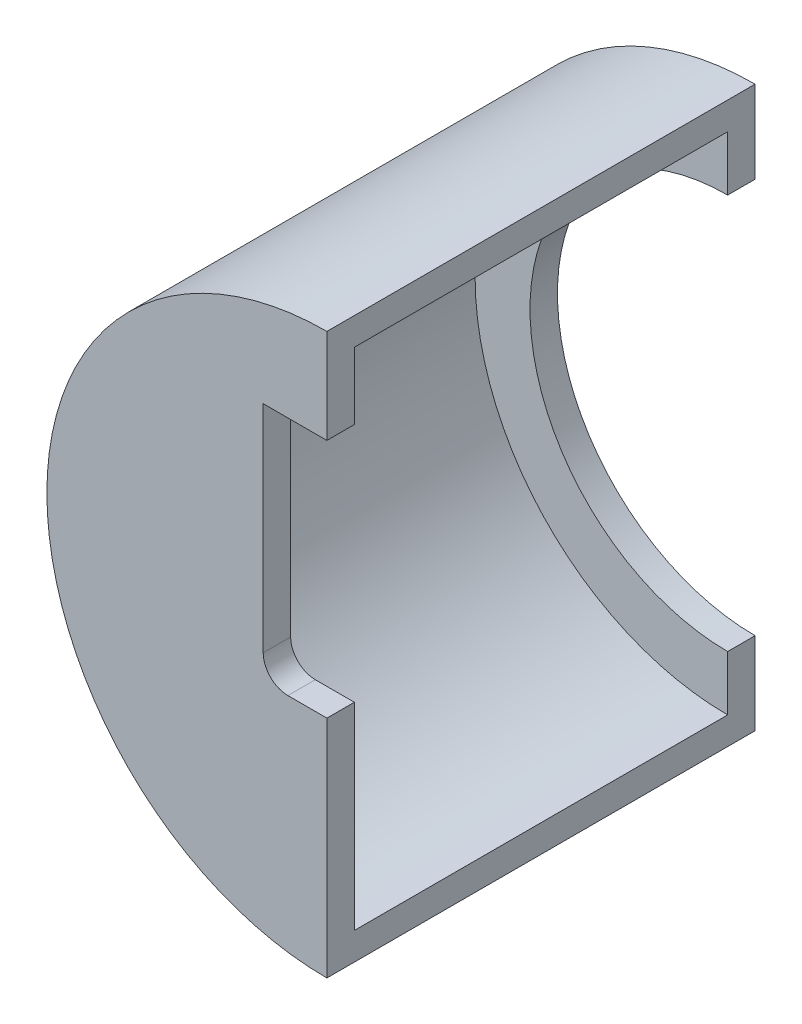
ISO-10303-21;
HEADER;
FILE_DESCRIPTION(('STEP AP214'),'2;1');
FILE_NAME('part.step','',(''),(''),'','','');
FILE_SCHEMA(('AUTOMOTIVE_DESIGN { 1 0 10303 214 1 1 1 1 }'));
ENDSEC;
DATA;
#1=APPLICATION_CONTEXT('core data for automotive mechanical design processes');
#2=APPLICATION_PROTOCOL_DEFINITION('international standard','automotive_design',2000,#1);
#3=PRODUCT_CONTEXT('',#1,'mechanical');
#4=PRODUCT('Part','Part','',(#3));
#5=PRODUCT_RELATED_PRODUCT_CATEGORY('part','',(#4));
#6=PRODUCT_DEFINITION_FORMATION('','',#4);
#7=PRODUCT_DEFINITION_CONTEXT('part definition',#1,'design');
#8=PRODUCT_DEFINITION('design','',#6,#7);
#9=PRODUCT_DEFINITION_SHAPE('','',#8);
#10=(LENGTH_UNIT() NAMED_UNIT(*) SI_UNIT(.MILLI.,.METRE.));
#11=(NAMED_UNIT(*) PLANE_ANGLE_UNIT() SI_UNIT($,.RADIAN.));
#12=(NAMED_UNIT(*) SI_UNIT($,.STERADIAN.) SOLID_ANGLE_UNIT());
#13=UNCERTAINTY_MEASURE_WITH_UNIT(LENGTH_MEASURE(1.E-05),#10,'distance_accuracy_value','');
#14=(GEOMETRIC_REPRESENTATION_CONTEXT(3) GLOBAL_UNCERTAINTY_ASSIGNED_CONTEXT((#13)) GLOBAL_UNIT_ASSIGNED_CONTEXT((#10,
#11,#12)) REPRESENTATION_CONTEXT('',''));
#15=CARTESIAN_POINT('',(0.,0.,0.));
#16=DIRECTION('',(0.,0.,1.));
#17=DIRECTION('',(1.,0.,0.));
#18=AXIS2_PLACEMENT_3D('',#15,#16,#17);
#19=CARTESIAN_POINT('',(0.,-46.,34.));
#20=DIRECTION('',(-1.,0.,0.));
#21=DIRECTION('',(0.,-1.,0.));
#22=AXIS2_PLACEMENT_3D('',#19,#20,#21);
#23=PLANE('',#22);
#24=DIRECTION('',(0.,0.,1.));
#25=VECTOR('',#24,1.);
#26=CARTESIAN_POINT('',(0.,33.8,29.));
#27=LINE('',#26,#25);
#28=CARTESIAN_POINT('',(0.,33.8,34.));
#29=VERTEX_POINT('',#28);
#30=CARTESIAN_POINT('',(0.,33.8,39.));
#31=VERTEX_POINT('',#30);
#32=EDGE_CURVE('E86',#29,#31,#27,.T.);
#33=ORIENTED_EDGE('',*,*,#32,.F.);
#34=DIRECTION('',(0.,1.,0.));
#35=VECTOR('',#34,1.);
#36=CARTESIAN_POINT('',(0.,51.,34.));
#37=LINE('',#36,#35);
#38=CARTESIAN_POINT('',(0.,46.,34.));
#39=VERTEX_POINT('',#38);
#40=EDGE_CURVE('E72',#29,#39,#37,.T.);
#41=ORIENTED_EDGE('',*,*,#40,.T.);
#42=DIRECTION('',(0.,0.,-1.));
#43=VECTOR('',#42,1.);
#44=CARTESIAN_POINT('',(0.,46.,34.));
#45=LINE('',#44,#43);
#46=CARTESIAN_POINT('',(0.,46.,-34.));
#47=VERTEX_POINT('',#46);
#48=EDGE_CURVE('E12',#39,#47,#45,.T.);
#49=ORIENTED_EDGE('',*,*,#48,.T.);
#50=DIRECTION('',(0.,-1.,0.));
#51=VECTOR('',#50,1.);
#52=CARTESIAN_POINT('',(0.,51.,-34.));
#53=LINE('',#52,#51);
#54=CARTESIAN_POINT('',(0.,36.,-34.));
#55=VERTEX_POINT('',#54);
#56=EDGE_CURVE('E199',#47,#55,#53,.T.);
#57=ORIENTED_EDGE('',*,*,#56,.T.);
#58=DIRECTION('',(0.,0.,1.));
#59=VECTOR('',#58,1.);
#60=CARTESIAN_POINT('',(0.,36.,-39.));
#61=LINE('',#60,#59);
#62=CARTESIAN_POINT('',(0.,36.,-39.));
#63=VERTEX_POINT('',#62);
#64=EDGE_CURVE('E260',#63,#55,#61,.T.);
#65=ORIENTED_EDGE('',*,*,#64,.F.);
#66=DIRECTION('',(0.,-1.,0.));
#67=VECTOR('',#66,1.);
#68=CARTESIAN_POINT('',(0.,51.,-39.));
#69=LINE('',#68,#67);
#70=CARTESIAN_POINT('',(0.,51.,-39.));
#71=VERTEX_POINT('',#70);
#72=EDGE_CURVE('E203',#71,#63,#69,.T.);
#73=ORIENTED_EDGE('',*,*,#72,.F.);
#74=DIRECTION('',(0.,0.,-1.));
#75=VECTOR('',#74,1.);
#76=CARTESIAN_POINT('',(0.,51.,34.));
#77=LINE('',#76,#75);
#78=CARTESIAN_POINT('',(0.,51.,39.));
#79=VERTEX_POINT('',#78);
#80=EDGE_CURVE('E78',#79,#71,#77,.T.);
#81=ORIENTED_EDGE('',*,*,#80,.F.);
#82=DIRECTION('',(0.,1.,0.));
#83=VECTOR('',#82,1.);
#84=CARTESIAN_POINT('',(0.,51.,39.));
#85=LINE('',#84,#83);
#86=EDGE_CURVE('E223',#31,#79,#85,.T.);
#87=ORIENTED_EDGE('',*,*,#86,.F.);
#88=EDGE_LOOP('',(#33,#41,#49,#57,#65,#73,#81,#87));
#89=FACE_BOUND('',#88,.T.);
#90=ADVANCED_FACE('F68',(#89),#23,.F.);
#91=CARTESIAN_POINT('',(0.,-46.,34.));
#92=VERTEX_POINT('',#91);
#93=CARTESIAN_POINT('',(0.,-10.000000044355,34.));
#94=VERTEX_POINT('',#93);
#95=EDGE_CURVE('E224',#92,#94,#37,.T.);
#96=ORIENTED_EDGE('',*,*,#95,.T.);
#97=DIRECTION('',(0.,0.,1.));
#98=VECTOR('',#97,1.);
#99=CARTESIAN_POINT('',(0.,-10.000000044355,29.));
#100=LINE('',#99,#98);
#101=CARTESIAN_POINT('',(0.,-10.000000044355,39.));
#102=VERTEX_POINT('',#101);
#103=EDGE_CURVE('E188',#94,#102,#100,.T.);
#104=ORIENTED_EDGE('',*,*,#103,.T.);
#105=CARTESIAN_POINT('',(0.,-51.,39.));
#106=VERTEX_POINT('',#105);
#107=EDGE_CURVE('E225',#106,#102,#85,.T.);
#108=ORIENTED_EDGE('',*,*,#107,.F.);
#109=DIRECTION('',(0.,0.,-1.));
#110=VECTOR('',#109,1.);
#111=CARTESIAN_POINT('',(0.,-51.,34.));
#112=LINE('',#111,#110);
#113=CARTESIAN_POINT('',(0.,-51.,-39.));
#114=VERTEX_POINT('',#113);
#115=EDGE_CURVE('E242',#106,#114,#112,.T.);
#116=ORIENTED_EDGE('',*,*,#115,.T.);
#117=DIRECTION('',(0.,-1.,0.));
#118=VECTOR('',#117,1.);
#119=CARTESIAN_POINT('',(0.,-51.,-39.));
#120=LINE('',#119,#118);
#121=CARTESIAN_POINT('',(0.,-36.,-39.));
#122=VERTEX_POINT('',#121);
#123=EDGE_CURVE('E208',#122,#114,#120,.T.);
#124=ORIENTED_EDGE('',*,*,#123,.F.);
#125=DIRECTION('',(0.,0.,1.));
#126=VECTOR('',#125,1.);
#127=CARTESIAN_POINT('',(0.,-36.,-39.));
#128=LINE('',#127,#126);
#129=CARTESIAN_POINT('',(0.,-36.,-34.));
#130=VERTEX_POINT('',#129);
#131=EDGE_CURVE('E211',#122,#130,#128,.T.);
#132=ORIENTED_EDGE('',*,*,#131,.T.);
#133=DIRECTION('',(0.,-1.,0.));
#134=VECTOR('',#133,1.);
#135=CARTESIAN_POINT('',(0.,-51.,-34.));
#136=LINE('',#135,#134);
#137=CARTESIAN_POINT('',(0.,-46.,-34.));
#138=VERTEX_POINT('',#137);
#139=EDGE_CURVE('E204',#130,#138,#136,.T.);
#140=ORIENTED_EDGE('',*,*,#139,.T.);
#141=DIRECTION('',(0.,0.,-1.));
#142=VECTOR('',#141,1.);
#143=CARTESIAN_POINT('',(0.,-46.,34.));
#144=LINE('',#143,#142);
#145=EDGE_CURVE('E95',#92,#138,#144,.T.);
#146=ORIENTED_EDGE('',*,*,#145,.F.);
#147=EDGE_LOOP('',(#96,#104,#108,#116,#124,#132,#140,#146));
#148=FACE_BOUND('',#147,.T.);
#149=ADVANCED_FACE('F252',(#148),#23,.F.);
#150=CARTESIAN_POINT('',(0.,0.,34.));
#151=DIRECTION('',(0.,0.,-1.));
#152=DIRECTION('',(-1.,0.,0.));
#153=AXIS2_PLACEMENT_3D('',#150,#151,#152);
#154=CYLINDRICAL_SURFACE('',#153,46.);
#155=CARTESIAN_POINT('',(0.,0.,-34.));
#156=DIRECTION('',(0.,0.,-1.));
#157=DIRECTION('',(1.,0.,0.));
#158=AXIS2_PLACEMENT_3D('',#155,#156,#157);
#159=CIRCLE('',#158,46.);
#160=EDGE_CURVE('E226',#138,#47,#159,.T.);
#161=ORIENTED_EDGE('',*,*,#160,.T.);
#162=ORIENTED_EDGE('',*,*,#48,.F.);
#163=CARTESIAN_POINT('',(0.,0.,34.));
#164=DIRECTION('',(0.,0.,-1.));
#165=DIRECTION('',(1.,0.,0.));
#166=AXIS2_PLACEMENT_3D('',#163,#164,#165);
#167=CIRCLE('',#166,46.);
#168=EDGE_CURVE('E236',#92,#39,#167,.T.);
#169=ORIENTED_EDGE('',*,*,#168,.F.);
#170=ORIENTED_EDGE('',*,*,#145,.T.);
#171=EDGE_LOOP('',(#161,#162,#169,#170));
#172=FACE_BOUND('',#171,.T.);
#173=ADVANCED_FACE('F70',(#172),#154,.F.);
#174=CARTESIAN_POINT('',(0.,0.,34.));
#175=DIRECTION('',(0.,0.,-1.));
#176=DIRECTION('',(-1.,0.,0.));
#177=AXIS2_PLACEMENT_3D('',#174,#175,#176);
#178=CYLINDRICAL_SURFACE('',#177,51.);
#179=ORIENTED_EDGE('',*,*,#80,.T.);
#180=CARTESIAN_POINT('',(0.,0.,-39.));
#181=DIRECTION('',(0.,0.,-1.));
#182=DIRECTION('',(-1.,0.,0.));
#183=AXIS2_PLACEMENT_3D('',#180,#181,#182);
#184=CIRCLE('',#183,51.);
#185=EDGE_CURVE('E200',#114,#71,#184,.T.);
#186=ORIENTED_EDGE('',*,*,#185,.F.);
#187=ORIENTED_EDGE('',*,*,#115,.F.);
#188=CARTESIAN_POINT('',(0.,0.,39.));
#189=DIRECTION('',(0.,0.,1.));
#190=DIRECTION('',(1.,0.,0.));
#191=AXIS2_PLACEMENT_3D('',#188,#189,#190);
#192=CIRCLE('',#191,51.);
#193=EDGE_CURVE('E220',#79,#106,#192,.T.);
#194=ORIENTED_EDGE('',*,*,#193,.F.);
#195=EDGE_LOOP('',(#179,#186,#187,#194));
#196=FACE_BOUND('',#195,.T.);
#197=ADVANCED_FACE('F276',(#196),#178,.T.);
#198=CARTESIAN_POINT('',(0.,0.,34.));
#199=DIRECTION('',(0.,0.,1.));
#200=DIRECTION('',(1.,0.,0.));
#201=AXIS2_PLACEMENT_3D('',#198,#199,#200);
#202=PLANE('',#201);
#203=CARTESIAN_POINT('',(-7.09999987129,-5.499999955645,34.));
#204=DIRECTION('',(0.,0.,1.));
#205=DIRECTION('',(1.,0.,0.));
#206=AXIS2_PLACEMENT_3D('',#203,#204,#205);
#207=CIRCLE('',#206,4.50000008871);
#208=CARTESIAN_POINT('',(-11.59999996,-5.499999955645,34.));
#209=VERTEX_POINT('',#208);
#210=CARTESIAN_POINT('',(-7.09999987129,-10.000000044355,34.));
#211=VERTEX_POINT('',#210);
#212=EDGE_CURVE('E165',#209,#211,#207,.T.);
#213=ORIENTED_EDGE('',*,*,#212,.T.);
#214=DIRECTION('',(1.,0.,0.));
#215=VECTOR('',#214,1.);
#216=CARTESIAN_POINT('',(0.,-10.000000044355,34.));
#217=LINE('',#216,#215);
#218=EDGE_CURVE('E196',#211,#94,#217,.T.);
#219=ORIENTED_EDGE('',*,*,#218,.T.);
#220=ORIENTED_EDGE('',*,*,#95,.F.);
#221=ORIENTED_EDGE('',*,*,#168,.T.);
#222=ORIENTED_EDGE('',*,*,#40,.F.);
#223=DIRECTION('',(1.,0.,0.));
#224=VECTOR('',#223,1.);
#225=CARTESIAN_POINT('',(0.,33.8,34.));
#226=LINE('',#225,#224);
#227=CARTESIAN_POINT('',(-11.59999996,33.8,34.));
#228=VERTEX_POINT('',#227);
#229=EDGE_CURVE('E186',#228,#29,#226,.T.);
#230=ORIENTED_EDGE('',*,*,#229,.F.);
#231=DIRECTION('',(0.,1.,0.));
#232=VECTOR('',#231,1.);
#233=CARTESIAN_POINT('',(-11.59999996,0.,34.));
#234=LINE('',#233,#232);
#235=EDGE_CURVE('E193',#209,#228,#234,.T.);
#236=ORIENTED_EDGE('',*,*,#235,.F.);
#237=EDGE_LOOP('',(#213,#219,#220,#221,#222,#230,#236));
#238=FACE_BOUND('',#237,.T.);
#239=ADVANCED_FACE('F269',(#238),#202,.F.);
#240=CARTESIAN_POINT('',(0.,0.,39.));
#241=DIRECTION('',(0.,0.,1.));
#242=DIRECTION('',(1.,0.,0.));
#243=AXIS2_PLACEMENT_3D('',#240,#241,#242);
#244=PLANE('',#243);
#245=DIRECTION('',(1.,0.,0.));
#246=VECTOR('',#245,1.);
#247=CARTESIAN_POINT('',(0.,-10.000000044355,39.));
#248=LINE('',#247,#246);
#249=CARTESIAN_POINT('',(-7.09999987129,-10.000000044355,39.));
#250=VERTEX_POINT('',#249);
#251=EDGE_CURVE('E180',#250,#102,#248,.T.);
#252=ORIENTED_EDGE('',*,*,#251,.F.);
#253=CARTESIAN_POINT('',(-7.09999987129,-5.499999955645,39.));
#254=DIRECTION('',(0.,0.,1.));
#255=DIRECTION('',(1.,0.,0.));
#256=AXIS2_PLACEMENT_3D('',#253,#254,#255);
#257=CIRCLE('',#256,4.50000008871);
#258=CARTESIAN_POINT('',(-11.59999996,-5.499999955645,39.));
#259=VERTEX_POINT('',#258);
#260=EDGE_CURVE('E162',#259,#250,#257,.T.);
#261=ORIENTED_EDGE('',*,*,#260,.F.);
#262=DIRECTION('',(0.,1.,0.));
#263=VECTOR('',#262,1.);
#264=CARTESIAN_POINT('',(-11.59999996,0.,39.));
#265=LINE('',#264,#263);
#266=CARTESIAN_POINT('',(-11.59999996,33.8,39.));
#267=VERTEX_POINT('',#266);
#268=EDGE_CURVE('E172',#259,#267,#265,.T.);
#269=ORIENTED_EDGE('',*,*,#268,.T.);
#270=DIRECTION('',(1.,0.,0.));
#271=VECTOR('',#270,1.);
#272=CARTESIAN_POINT('',(0.,33.8,39.));
#273=LINE('',#272,#271);
#274=EDGE_CURVE('E169',#267,#31,#273,.T.);
#275=ORIENTED_EDGE('',*,*,#274,.T.);
#276=ORIENTED_EDGE('',*,*,#86,.T.);
#277=ORIENTED_EDGE('',*,*,#193,.T.);
#278=ORIENTED_EDGE('',*,*,#107,.T.);
#279=EDGE_LOOP('',(#252,#261,#269,#275,#276,#277,#278));
#280=FACE_BOUND('',#279,.T.);
#281=ADVANCED_FACE('F178',(#280),#244,.T.);
#282=CARTESIAN_POINT('',(0.,0.,-39.));
#283=DIRECTION('',(0.,0.,1.));
#284=DIRECTION('',(1.,0.,0.));
#285=AXIS2_PLACEMENT_3D('',#282,#283,#284);
#286=CYLINDRICAL_SURFACE('',#285,36.);
#287=CARTESIAN_POINT('',(0.,0.,-34.));
#288=DIRECTION('',(0.,0.,1.));
#289=DIRECTION('',(-1.,0.,0.));
#290=AXIS2_PLACEMENT_3D('',#287,#288,#289);
#291=CIRCLE('',#290,36.);
#292=EDGE_CURVE('E214',#55,#130,#291,.T.);
#293=ORIENTED_EDGE('',*,*,#292,.T.);
#294=ORIENTED_EDGE('',*,*,#131,.F.);
#295=CARTESIAN_POINT('',(0.,0.,-39.));
#296=DIRECTION('',(0.,0.,1.));
#297=DIRECTION('',(-1.,0.,0.));
#298=AXIS2_PLACEMENT_3D('',#295,#296,#297);
#299=CIRCLE('',#298,36.);
#300=EDGE_CURVE('E206',#63,#122,#299,.T.);
#301=ORIENTED_EDGE('',*,*,#300,.F.);
#302=ORIENTED_EDGE('',*,*,#64,.T.);
#303=EDGE_LOOP('',(#293,#294,#301,#302));
#304=FACE_BOUND('',#303,.T.);
#305=ADVANCED_FACE('F257',(#304),#286,.F.);
#306=CARTESIAN_POINT('',(0.,0.,-39.));
#307=DIRECTION('',(0.,0.,-1.));
#308=DIRECTION('',(-1.,0.,0.));
#309=AXIS2_PLACEMENT_3D('',#306,#307,#308);
#310=PLANE('',#309);
#311=ORIENTED_EDGE('',*,*,#185,.T.);
#312=ORIENTED_EDGE('',*,*,#72,.T.);
#313=ORIENTED_EDGE('',*,*,#300,.T.);
#314=ORIENTED_EDGE('',*,*,#123,.T.);
#315=EDGE_LOOP('',(#311,#312,#313,#314));
#316=FACE_BOUND('',#315,.T.);
#317=ADVANCED_FACE('F280',(#316),#310,.T.);
#318=CARTESIAN_POINT('',(0.,0.,-34.));
#319=DIRECTION('',(0.,0.,-1.));
#320=DIRECTION('',(-1.,0.,0.));
#321=AXIS2_PLACEMENT_3D('',#318,#319,#320);
#322=PLANE('',#321);
#323=ORIENTED_EDGE('',*,*,#160,.F.);
#324=ORIENTED_EDGE('',*,*,#139,.F.);
#325=ORIENTED_EDGE('',*,*,#292,.F.);
#326=ORIENTED_EDGE('',*,*,#56,.F.);
#327=EDGE_LOOP('',(#323,#324,#325,#326));
#328=FACE_BOUND('',#327,.T.);
#329=ADVANCED_FACE('F249',(#328),#322,.F.);
#330=CARTESIAN_POINT('',(0.,-10.000000044355,29.));
#331=DIRECTION('',(0.,-1.,0.));
#332=DIRECTION('',(0.,0.,-1.));
#333=AXIS2_PLACEMENT_3D('',#330,#331,#332);
#334=PLANE('',#333);
#335=DIRECTION('',(0.,0.,1.));
#336=VECTOR('',#335,1.);
#337=CARTESIAN_POINT('',(-7.09999987129,-10.000000044355,29.));
#338=LINE('',#337,#336);
#339=EDGE_CURVE('E168',#211,#250,#338,.T.);
#340=ORIENTED_EDGE('',*,*,#339,.T.);
#341=ORIENTED_EDGE('',*,*,#251,.T.);
#342=ORIENTED_EDGE('',*,*,#103,.F.);
#343=ORIENTED_EDGE('',*,*,#218,.F.);
#344=EDGE_LOOP('',(#340,#341,#342,#343));
#345=FACE_BOUND('',#344,.T.);
#346=ADVANCED_FACE('F287',(#345),#334,.F.);
#347=CARTESIAN_POINT('',(-7.09999987129,-5.499999955645,29.));
#348=DIRECTION('',(0.,0.,1.));
#349=DIRECTION('',(1.,0.,0.));
#350=AXIS2_PLACEMENT_3D('',#347,#348,#349);
#351=CYLINDRICAL_SURFACE('',#350,4.50000008871);
#352=DIRECTION('',(0.,0.,1.));
#353=VECTOR('',#352,1.);
#354=CARTESIAN_POINT('',(-11.59999996,-5.499999955645,29.));
#355=LINE('',#354,#353);
#356=EDGE_CURVE('E157',#209,#259,#355,.T.);
#357=ORIENTED_EDGE('',*,*,#356,.T.);
#358=ORIENTED_EDGE('',*,*,#260,.T.);
#359=ORIENTED_EDGE('',*,*,#339,.F.);
#360=ORIENTED_EDGE('',*,*,#212,.F.);
#361=EDGE_LOOP('',(#357,#358,#359,#360));
#362=FACE_BOUND('',#361,.T.);
#363=ADVANCED_FACE('F159',(#362),#351,.F.);
#364=CARTESIAN_POINT('',(-11.59999996,0.,29.));
#365=DIRECTION('',(1.,0.,0.));
#366=DIRECTION('',(0.,1.,0.));
#367=AXIS2_PLACEMENT_3D('',#364,#365,#366);
#368=PLANE('',#367);
#369=ORIENTED_EDGE('',*,*,#235,.T.);
#370=DIRECTION('',(0.,0.,1.));
#371=VECTOR('',#370,1.);
#372=CARTESIAN_POINT('',(-11.59999996,33.8,29.));
#373=LINE('',#372,#371);
#374=EDGE_CURVE('E175',#228,#267,#373,.T.);
#375=ORIENTED_EDGE('',*,*,#374,.T.);
#376=ORIENTED_EDGE('',*,*,#268,.F.);
#377=ORIENTED_EDGE('',*,*,#356,.F.);
#378=EDGE_LOOP('',(#369,#375,#376,#377));
#379=FACE_BOUND('',#378,.T.);
#380=ADVANCED_FACE('F173',(#379),#368,.T.);
#381=CARTESIAN_POINT('',(0.,33.8,29.));
#382=DIRECTION('',(0.,-1.,0.));
#383=DIRECTION('',(0.,0.,-1.));
#384=AXIS2_PLACEMENT_3D('',#381,#382,#383);
#385=PLANE('',#384);
#386=ORIENTED_EDGE('',*,*,#229,.T.);
#387=ORIENTED_EDGE('',*,*,#32,.T.);
#388=ORIENTED_EDGE('',*,*,#274,.F.);
#389=ORIENTED_EDGE('',*,*,#374,.F.);
#390=EDGE_LOOP('',(#386,#387,#388,#389));
#391=FACE_BOUND('',#390,.T.);
#392=ADVANCED_FACE('F355',(#391),#385,.T.);
#393=CLOSED_SHELL('',(#90,#149,#173,#197,#239,#281,#305,#317,#329,#346,#363,#380,#392));
#394=MANIFOLD_SOLID_BREP('B2',#393);
#395=ADVANCED_BREP_SHAPE_REPRESENTATION('',(#18,#394),#14);
#396=SHAPE_DEFINITION_REPRESENTATION(#9,#395);
ENDSEC;
END-ISO-10303-21;
